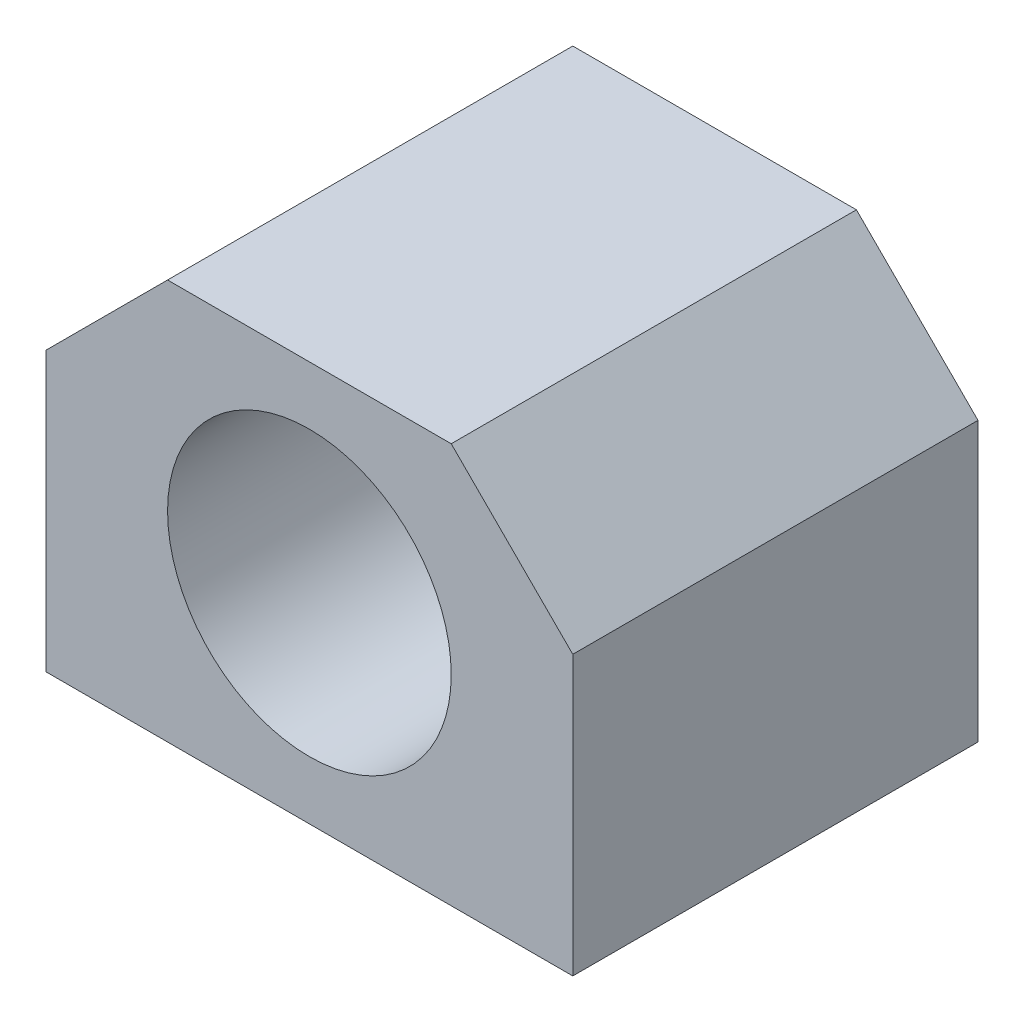
ISO-10303-21;
HEADER;
FILE_DESCRIPTION(('STEP AP214'),'2;1');
FILE_NAME('part.step','',(''),(''),'','','');
FILE_SCHEMA(('AUTOMOTIVE_DESIGN { 1 0 10303 214 1 1 1 1 }'));
ENDSEC;
DATA;
#1=APPLICATION_CONTEXT('core data for automotive mechanical design processes');
#2=APPLICATION_PROTOCOL_DEFINITION('international standard','automotive_design',2000,#1);
#3=PRODUCT_CONTEXT('',#1,'mechanical');
#4=PRODUCT('Part','Part','',(#3));
#5=PRODUCT_RELATED_PRODUCT_CATEGORY('part','',(#4));
#6=PRODUCT_DEFINITION_FORMATION('','',#4);
#7=PRODUCT_DEFINITION_CONTEXT('part definition',#1,'design');
#8=PRODUCT_DEFINITION('design','',#6,#7);
#9=PRODUCT_DEFINITION_SHAPE('','',#8);
#10=(LENGTH_UNIT() NAMED_UNIT(*) SI_UNIT(.MILLI.,.METRE.));
#11=(NAMED_UNIT(*) PLANE_ANGLE_UNIT() SI_UNIT($,.RADIAN.));
#12=(NAMED_UNIT(*) SI_UNIT($,.STERADIAN.) SOLID_ANGLE_UNIT());
#13=UNCERTAINTY_MEASURE_WITH_UNIT(LENGTH_MEASURE(1.E-05),#10,'distance_accuracy_value','');
#14=(GEOMETRIC_REPRESENTATION_CONTEXT(3) GLOBAL_UNCERTAINTY_ASSIGNED_CONTEXT((#13)) GLOBAL_UNIT_ASSIGNED_CONTEXT((#10,
#11,#12)) REPRESENTATION_CONTEXT('',''));
#15=CARTESIAN_POINT('',(0.,0.,0.));
#16=DIRECTION('',(0.,0.,1.));
#17=DIRECTION('',(1.,0.,0.));
#18=AXIS2_PLACEMENT_3D('',#15,#16,#17);
#19=CARTESIAN_POINT('',(0.,-19.75,40.));
#20=DIRECTION('',(0.,1.,0.));
#21=DIRECTION('',(0.,0.,1.));
#22=AXIS2_PLACEMENT_3D('',#19,#20,#21);
#23=PLANE('',#22);
#24=CARTESIAN_POINT('',(-20.,-19.75,8.));
#25=DIRECTION('',(0.,-1.,0.));
#26=DIRECTION('',(0.,0.,-1.));
#27=AXIS2_PLACEMENT_3D('',#24,#25,#26);
#28=CIRCLE('',#27,2.5);
#29=CARTESIAN_POINT('',(-20.,-19.75,5.5));
#30=VERTEX_POINT('',#29);
#31=EDGE_CURVE('E206',#30,#30,#28,.T.);
#32=ORIENTED_EDGE('',*,*,#31,.F.);
#33=EDGE_LOOP('',(#32));
#34=FACE_BOUND('',#33,.T.);
#35=CARTESIAN_POINT('',(20.,-19.75,32.));
#36=DIRECTION('',(0.,-1.,0.));
#37=DIRECTION('',(0.,0.,-1.));
#38=AXIS2_PLACEMENT_3D('',#35,#36,#37);
#39=CIRCLE('',#38,2.5);
#40=CARTESIAN_POINT('',(20.,-19.75,29.5));
#41=VERTEX_POINT('',#40);
#42=EDGE_CURVE('E200',#41,#41,#39,.T.);
#43=ORIENTED_EDGE('',*,*,#42,.F.);
#44=EDGE_LOOP('',(#43));
#45=FACE_BOUND('',#44,.T.);
#46=CARTESIAN_POINT('',(-20.,-19.75,32.));
#47=DIRECTION('',(0.,-1.,0.));
#48=DIRECTION('',(0.,0.,-1.));
#49=AXIS2_PLACEMENT_3D('',#46,#47,#48);
#50=CIRCLE('',#49,2.5);
#51=CARTESIAN_POINT('',(-20.,-19.75,29.5));
#52=VERTEX_POINT('',#51);
#53=EDGE_CURVE('E194',#52,#52,#50,.T.);
#54=ORIENTED_EDGE('',*,*,#53,.F.);
#55=EDGE_LOOP('',(#54));
#56=FACE_BOUND('',#55,.T.);
#57=CARTESIAN_POINT('',(20.,-19.75,8.00000000000001));
#58=DIRECTION('',(0.,-1.,0.));
#59=DIRECTION('',(0.,0.,-1.));
#60=AXIS2_PLACEMENT_3D('',#57,#58,#59);
#61=CIRCLE('',#60,2.5);
#62=CARTESIAN_POINT('',(20.,-19.75,5.50000000000001));
#63=VERTEX_POINT('',#62);
#64=EDGE_CURVE('E188',#63,#63,#61,.T.);
#65=ORIENTED_EDGE('',*,*,#64,.F.);
#66=EDGE_LOOP('',(#65));
#67=FACE_BOUND('',#66,.T.);
#68=DIRECTION('',(1.,0.,0.));
#69=VECTOR('',#68,1.);
#70=CARTESIAN_POINT('',(0.,-19.75,0.));
#71=LINE('',#70,#69);
#72=CARTESIAN_POINT('',(-26.,-19.75,0.));
#73=VERTEX_POINT('',#72);
#74=CARTESIAN_POINT('',(26.,-19.75,0.));
#75=VERTEX_POINT('',#74);
#76=EDGE_CURVE('E103',#73,#75,#71,.T.);
#77=ORIENTED_EDGE('',*,*,#76,.T.);
#78=DIRECTION('',(0.,0.,-1.));
#79=VECTOR('',#78,1.);
#80=CARTESIAN_POINT('',(26.,-19.75,40.));
#81=LINE('',#80,#79);
#82=CARTESIAN_POINT('',(26.,-19.75,40.));
#83=VERTEX_POINT('',#82);
#84=EDGE_CURVE('E89',#83,#75,#81,.T.);
#85=ORIENTED_EDGE('',*,*,#84,.F.);
#86=DIRECTION('',(1.,0.,0.));
#87=VECTOR('',#86,1.);
#88=CARTESIAN_POINT('',(0.,-19.75,40.));
#89=LINE('',#88,#87);
#90=CARTESIAN_POINT('',(-26.,-19.75,40.));
#91=VERTEX_POINT('',#90);
#92=EDGE_CURVE('E92',#91,#83,#89,.T.);
#93=ORIENTED_EDGE('',*,*,#92,.F.);
#94=DIRECTION('',(0.,0.,-1.));
#95=VECTOR('',#94,1.);
#96=CARTESIAN_POINT('',(-26.,-19.75,40.));
#97=LINE('',#96,#95);
#98=EDGE_CURVE('E105',#91,#73,#97,.T.);
#99=ORIENTED_EDGE('',*,*,#98,.T.);
#100=EDGE_LOOP('',(#77,#85,#93,#99));
#101=FACE_BOUND('',#100,.T.);
#102=ADVANCED_FACE('F34',(#34,#45,#56,#67,#101),#23,.F.);
#103=CARTESIAN_POINT('',(26.,0.,40.));
#104=DIRECTION('',(-1.,0.,0.));
#105=DIRECTION('',(0.,0.,1.));
#106=AXIS2_PLACEMENT_3D('',#103,#104,#105);
#107=PLANE('',#106);
#108=DIRECTION('',(0.,1.,0.));
#109=VECTOR('',#108,1.);
#110=CARTESIAN_POINT('',(26.,0.,0.));
#111=LINE('',#110,#109);
#112=CARTESIAN_POINT('',(26.,7.74999999999996,0.));
#113=VERTEX_POINT('',#112);
#114=EDGE_CURVE('E140',#75,#113,#111,.T.);
#115=ORIENTED_EDGE('',*,*,#114,.T.);
#116=DIRECTION('',(0.,0.,1.));
#117=VECTOR('',#116,1.);
#118=CARTESIAN_POINT('',(26.,7.74999999999996,40.));
#119=LINE('',#118,#117);
#120=CARTESIAN_POINT('',(26.,7.74999999999996,40.));
#121=VERTEX_POINT('',#120);
#122=EDGE_CURVE('E11',#113,#121,#119,.T.);
#123=ORIENTED_EDGE('',*,*,#122,.T.);
#124=DIRECTION('',(0.,1.,0.));
#125=VECTOR('',#124,1.);
#126=CARTESIAN_POINT('',(26.,0.,40.));
#127=LINE('',#126,#125);
#128=EDGE_CURVE('E85',#83,#121,#127,.T.);
#129=ORIENTED_EDGE('',*,*,#128,.F.);
#130=ORIENTED_EDGE('',*,*,#84,.T.);
#131=EDGE_LOOP('',(#115,#123,#129,#130));
#132=FACE_BOUND('',#131,.T.);
#133=ADVANCED_FACE('F87',(#132),#107,.F.);
#134=CARTESIAN_POINT('',(0.,19.75,40.));
#135=DIRECTION('',(0.,1.,0.));
#136=DIRECTION('',(0.,0.,1.));
#137=AXIS2_PLACEMENT_3D('',#134,#135,#136);
#138=PLANE('',#137);
#139=DIRECTION('',(1.,0.,0.));
#140=VECTOR('',#139,1.);
#141=CARTESIAN_POINT('',(0.,19.75,0.));
#142=LINE('',#141,#140);
#143=CARTESIAN_POINT('',(-13.9999999999999,19.75,0.));
#144=VERTEX_POINT('',#143);
#145=CARTESIAN_POINT('',(14.,19.75,0.));
#146=VERTEX_POINT('',#145);
#147=EDGE_CURVE('E135',#144,#146,#142,.T.);
#148=ORIENTED_EDGE('',*,*,#147,.F.);
#149=DIRECTION('',(0.,0.,1.));
#150=VECTOR('',#149,1.);
#151=CARTESIAN_POINT('',(-13.9999999999999,19.75,40.));
#152=LINE('',#151,#150);
#153=CARTESIAN_POINT('',(-13.9999999999999,19.75,40.));
#154=VERTEX_POINT('',#153);
#155=EDGE_CURVE('E119',#144,#154,#152,.T.);
#156=ORIENTED_EDGE('',*,*,#155,.T.);
#157=DIRECTION('',(1.,0.,0.));
#158=VECTOR('',#157,1.);
#159=CARTESIAN_POINT('',(0.,19.75,40.));
#160=LINE('',#159,#158);
#161=CARTESIAN_POINT('',(14.,19.75,40.));
#162=VERTEX_POINT('',#161);
#163=EDGE_CURVE('E91',#154,#162,#160,.T.);
#164=ORIENTED_EDGE('',*,*,#163,.T.);
#165=DIRECTION('',(0.,0.,-1.));
#166=VECTOR('',#165,1.);
#167=CARTESIAN_POINT('',(14.,19.75,0.));
#168=LINE('',#167,#166);
#169=EDGE_CURVE('E116',#162,#146,#168,.T.);
#170=ORIENTED_EDGE('',*,*,#169,.T.);
#171=EDGE_LOOP('',(#148,#156,#164,#170));
#172=FACE_BOUND('',#171,.T.);
#173=ADVANCED_FACE('F138',(#172),#138,.T.);
#174=CARTESIAN_POINT('',(0.,0.,40.));
#175=DIRECTION('',(0.,0.,-1.));
#176=DIRECTION('',(-1.,0.,0.));
#177=AXIS2_PLACEMENT_3D('',#174,#175,#176);
#178=CYLINDRICAL_SURFACE('',#177,14.);
#179=CARTESIAN_POINT('',(0.,0.,40.));
#180=DIRECTION('',(0.,0.,1.));
#181=DIRECTION('',(1.,0.,0.));
#182=AXIS2_PLACEMENT_3D('',#179,#180,#181);
#183=CIRCLE('',#182,14.);
#184=CARTESIAN_POINT('',(14.,0.,40.));
#185=VERTEX_POINT('',#184);
#186=EDGE_CURVE('E100',#185,#185,#183,.T.);
#187=ORIENTED_EDGE('',*,*,#186,.T.);
#188=EDGE_LOOP('',(#187));
#189=FACE_BOUND('',#188,.T.);
#190=CARTESIAN_POINT('',(0.,0.,0.));
#191=DIRECTION('',(0.,0.,1.));
#192=DIRECTION('',(1.,0.,0.));
#193=AXIS2_PLACEMENT_3D('',#190,#191,#192);
#194=CIRCLE('',#193,14.);
#195=CARTESIAN_POINT('',(14.,0.,0.));
#196=VERTEX_POINT('',#195);
#197=EDGE_CURVE('E145',#196,#196,#194,.T.);
#198=ORIENTED_EDGE('',*,*,#197,.F.);
#199=EDGE_LOOP('',(#198));
#200=FACE_BOUND('',#199,.T.);
#201=ADVANCED_FACE('F300',(#189,#200),#178,.F.);
#202=CARTESIAN_POINT('',(-26.,0.,40.));
#203=DIRECTION('',(-1.,0.,0.));
#204=DIRECTION('',(0.,0.,1.));
#205=AXIS2_PLACEMENT_3D('',#202,#203,#204);
#206=PLANE('',#205);
#207=DIRECTION('',(0.,1.,0.));
#208=VECTOR('',#207,1.);
#209=CARTESIAN_POINT('',(-26.,0.,40.));
#210=LINE('',#209,#208);
#211=CARTESIAN_POINT('',(-26.,7.74999999999999,40.));
#212=VERTEX_POINT('',#211);
#213=EDGE_CURVE('E98',#91,#212,#210,.T.);
#214=ORIENTED_EDGE('',*,*,#213,.T.);
#215=DIRECTION('',(0.,0.,-1.));
#216=VECTOR('',#215,1.);
#217=CARTESIAN_POINT('',(-26.,7.74999999999999,40.));
#218=LINE('',#217,#216);
#219=CARTESIAN_POINT('',(-26.,7.74999999999999,0.));
#220=VERTEX_POINT('',#219);
#221=EDGE_CURVE('E104',#212,#220,#218,.T.);
#222=ORIENTED_EDGE('',*,*,#221,.T.);
#223=DIRECTION('',(0.,1.,0.));
#224=VECTOR('',#223,1.);
#225=CARTESIAN_POINT('',(-26.,0.,0.));
#226=LINE('',#225,#224);
#227=EDGE_CURVE('E136',#73,#220,#226,.T.);
#228=ORIENTED_EDGE('',*,*,#227,.F.);
#229=ORIENTED_EDGE('',*,*,#98,.F.);
#230=EDGE_LOOP('',(#214,#222,#228,#229));
#231=FACE_BOUND('',#230,.T.);
#232=ADVANCED_FACE('F126',(#231),#206,.T.);
#233=CARTESIAN_POINT('',(0.,0.,40.));
#234=DIRECTION('',(0.,0.,1.));
#235=DIRECTION('',(1.,0.,0.));
#236=AXIS2_PLACEMENT_3D('',#233,#234,#235);
#237=PLANE('',#236);
#238=ORIENTED_EDGE('',*,*,#186,.F.);
#239=EDGE_LOOP('',(#238));
#240=FACE_BOUND('',#239,.T.);
#241=ORIENTED_EDGE('',*,*,#163,.F.);
#242=DIRECTION('',(0.707106781186549,0.707106781186546,0.));
#243=VECTOR('',#242,1.);
#244=CARTESIAN_POINT('',(-16.875,16.875,40.));
#245=LINE('',#244,#243);
#246=EDGE_CURVE('E42',#154,#212,#245,.F.);
#247=ORIENTED_EDGE('',*,*,#246,.T.);
#248=ORIENTED_EDGE('',*,*,#213,.F.);
#249=ORIENTED_EDGE('',*,*,#92,.T.);
#250=ORIENTED_EDGE('',*,*,#128,.T.);
#251=DIRECTION('',(-0.707106781186546,0.707106781186549,0.));
#252=VECTOR('',#251,1.);
#253=CARTESIAN_POINT('',(16.875,16.875,40.));
#254=LINE('',#253,#252);
#255=EDGE_CURVE('E54',#121,#162,#254,.T.);
#256=ORIENTED_EDGE('',*,*,#255,.T.);
#257=EDGE_LOOP('',(#241,#247,#248,#249,#250,#256));
#258=FACE_BOUND('',#257,.T.);
#259=ADVANCED_FACE('F96',(#240,#258),#237,.T.);
#260=CARTESIAN_POINT('',(0.,0.,0.));
#261=DIRECTION('',(0.,0.,1.));
#262=DIRECTION('',(1.,0.,0.));
#263=AXIS2_PLACEMENT_3D('',#260,#261,#262);
#264=PLANE('',#263);
#265=CARTESIAN_POINT('',(18.75,0.,0.));
#266=DIRECTION('',(0.,0.,1.));
#267=DIRECTION('',(1.,0.,0.));
#268=AXIS2_PLACEMENT_3D('',#265,#266,#267);
#269=CIRCLE('',#268,2.5);
#270=CARTESIAN_POINT('',(21.25,0.,0.));
#271=VERTEX_POINT('',#270);
#272=EDGE_CURVE('E183',#271,#271,#269,.T.);
#273=ORIENTED_EDGE('',*,*,#272,.T.);
#274=EDGE_LOOP('',(#273));
#275=FACE_BOUND('',#274,.T.);
#276=CARTESIAN_POINT('',(13.2582521472489,-13.2582521472482,0.));
#277=DIRECTION('',(0.,0.,1.));
#278=DIRECTION('',(1.,0.,0.));
#279=AXIS2_PLACEMENT_3D('',#276,#277,#278);
#280=CIRCLE('',#279,2.49999999999881);
#281=CARTESIAN_POINT('',(15.7582521472477,-13.2582521472482,0.));
#282=VERTEX_POINT('',#281);
#283=EDGE_CURVE('E177',#282,#282,#280,.T.);
#284=ORIENTED_EDGE('',*,*,#283,.T.);
#285=EDGE_LOOP('',(#284));
#286=FACE_BOUND('',#285,.T.);
#287=CARTESIAN_POINT('',(-13.2582521472467,-13.2582521472504,0.));
#288=DIRECTION('',(0.,0.,1.));
#289=DIRECTION('',(1.,0.,0.));
#290=AXIS2_PLACEMENT_3D('',#287,#288,#289);
#291=CIRCLE('',#290,2.49999999999815);
#292=CARTESIAN_POINT('',(-10.7582521472485,-13.2582521472504,0.));
#293=VERTEX_POINT('',#292);
#294=EDGE_CURVE('E171',#293,#293,#291,.T.);
#295=ORIENTED_EDGE('',*,*,#294,.T.);
#296=EDGE_LOOP('',(#295));
#297=FACE_BOUND('',#296,.T.);
#298=CARTESIAN_POINT('',(-18.75,-3.10840992437321E-12,0.));
#299=DIRECTION('',(0.,0.,1.));
#300=DIRECTION('',(1.,0.,0.));
#301=AXIS2_PLACEMENT_3D('',#298,#299,#300);
#302=CIRCLE('',#301,2.49999999999905);
#303=CARTESIAN_POINT('',(-16.250000000001,-3.10840992437321E-12,0.));
#304=VERTEX_POINT('',#303);
#305=EDGE_CURVE('E165',#304,#304,#302,.T.);
#306=ORIENTED_EDGE('',*,*,#305,.T.);
#307=EDGE_LOOP('',(#306));
#308=FACE_BOUND('',#307,.T.);
#309=CARTESIAN_POINT('',(-13.2582521472489,13.2582521472451,0.));
#310=DIRECTION('',(0.,0.,1.));
#311=DIRECTION('',(1.,0.,0.));
#312=AXIS2_PLACEMENT_3D('',#309,#310,#311);
#313=CIRCLE('',#312,2.50000000000023);
#314=CARTESIAN_POINT('',(-10.7582521472486,13.2582521472451,0.));
#315=VERTEX_POINT('',#314);
#316=EDGE_CURVE('E158',#315,#315,#313,.T.);
#317=ORIENTED_EDGE('',*,*,#316,.T.);
#318=EDGE_LOOP('',(#317));
#319=FACE_BOUND('',#318,.T.);
#320=CARTESIAN_POINT('',(13.2582521472467,13.2582521472473,0.));
#321=DIRECTION('',(0.,0.,1.));
#322=DIRECTION('',(1.,0.,0.));
#323=AXIS2_PLACEMENT_3D('',#320,#321,#322);
#324=CIRCLE('',#323,2.50000000000085);
#325=CARTESIAN_POINT('',(15.7582521472475,13.2582521472473,0.));
#326=VERTEX_POINT('',#325);
#327=EDGE_CURVE('E152',#326,#326,#324,.T.);
#328=ORIENTED_EDGE('',*,*,#327,.T.);
#329=EDGE_LOOP('',(#328));
#330=FACE_BOUND('',#329,.T.);
#331=ORIENTED_EDGE('',*,*,#197,.T.);
#332=EDGE_LOOP('',(#331));
#333=FACE_BOUND('',#332,.T.);
#334=ORIENTED_EDGE('',*,*,#227,.T.);
#335=DIRECTION('',(-0.707106781186549,-0.707106781186546,0.));
#336=VECTOR('',#335,1.);
#337=CARTESIAN_POINT('',(-26.,7.74999999999999,0.));
#338=LINE('',#337,#336);
#339=EDGE_CURVE('E114',#220,#144,#338,.F.);
#340=ORIENTED_EDGE('',*,*,#339,.T.);
#341=ORIENTED_EDGE('',*,*,#147,.T.);
#342=DIRECTION('',(0.707106781186546,-0.707106781186549,0.));
#343=VECTOR('',#342,1.);
#344=CARTESIAN_POINT('',(14.,19.75,0.));
#345=LINE('',#344,#343);
#346=EDGE_CURVE('E108',#146,#113,#345,.T.);
#347=ORIENTED_EDGE('',*,*,#346,.T.);
#348=ORIENTED_EDGE('',*,*,#114,.F.);
#349=ORIENTED_EDGE('',*,*,#76,.F.);
#350=EDGE_LOOP('',(#334,#340,#341,#347,#348,#349));
#351=FACE_BOUND('',#350,.T.);
#352=ADVANCED_FACE('F134',(#275,#286,#297,#308,#319,#330,#333,#351),#264,.F.);
#353=CARTESIAN_POINT('',(-26.,7.74999999999999,40.));
#354=DIRECTION('',(0.707106781186546,-0.707106781186549,0.));
#355=DIRECTION('',(0.,0.,-1.));
#356=AXIS2_PLACEMENT_3D('',#353,#354,#355);
#357=PLANE('',#356);
#358=ORIENTED_EDGE('',*,*,#246,.F.);
#359=ORIENTED_EDGE('',*,*,#155,.F.);
#360=ORIENTED_EDGE('',*,*,#339,.F.);
#361=ORIENTED_EDGE('',*,*,#221,.F.);
#362=EDGE_LOOP('',(#358,#359,#360,#361));
#363=FACE_BOUND('',#362,.T.);
#364=ADVANCED_FACE('F130',(#363),#357,.F.);
#365=CARTESIAN_POINT('',(14.,19.75,40.));
#366=DIRECTION('',(0.707106781186549,0.707106781186546,0.));
#367=DIRECTION('',(0.,0.,1.));
#368=AXIS2_PLACEMENT_3D('',#365,#366,#367);
#369=PLANE('',#368);
#370=ORIENTED_EDGE('',*,*,#255,.F.);
#371=ORIENTED_EDGE('',*,*,#122,.F.);
#372=ORIENTED_EDGE('',*,*,#346,.F.);
#373=ORIENTED_EDGE('',*,*,#169,.F.);
#374=EDGE_LOOP('',(#370,#371,#372,#373));
#375=FACE_BOUND('',#374,.T.);
#376=ADVANCED_FACE('F36',(#375),#369,.T.);
#377=CARTESIAN_POINT('',(13.2582521472467,13.2582521472473,16.5));
#378=DIRECTION('',(0.,0.,-1.));
#379=DIRECTION('',(-1.,0.,0.));
#380=AXIS2_PLACEMENT_3D('',#377,#378,#379);
#381=CYLINDRICAL_SURFACE('',#380,2.50000000000085);
#382=CARTESIAN_POINT('',(13.2582521472467,13.2582521472473,16.5));
#383=DIRECTION('',(0.,0.,1.));
#384=DIRECTION('',(1.,0.,0.));
#385=AXIS2_PLACEMENT_3D('',#382,#383,#384);
#386=CIRCLE('',#385,2.50000000000085);
#387=CARTESIAN_POINT('',(15.7582521472475,13.2582521472473,16.5));
#388=VERTEX_POINT('',#387);
#389=EDGE_CURVE('E147',#388,#388,#386,.T.);
#390=ORIENTED_EDGE('',*,*,#389,.T.);
#391=EDGE_LOOP('',(#390));
#392=FACE_BOUND('',#391,.T.);
#393=ORIENTED_EDGE('',*,*,#327,.F.);
#394=EDGE_LOOP('',(#393));
#395=FACE_BOUND('',#394,.T.);
#396=ADVANCED_FACE('F287',(#392,#395),#381,.F.);
#397=CARTESIAN_POINT('',(0.,0.,16.5));
#398=DIRECTION('',(0.,0.,1.));
#399=DIRECTION('',(1.,0.,0.));
#400=AXIS2_PLACEMENT_3D('',#397,#398,#399);
#401=PLANE('',#400);
#402=ORIENTED_EDGE('',*,*,#389,.F.);
#403=EDGE_LOOP('',(#402));
#404=FACE_BOUND('',#403,.T.);
#405=ADVANCED_FACE('F283',(#404),#401,.F.);
#406=CARTESIAN_POINT('',(-13.2582521472489,13.2582521472451,16.5));
#407=DIRECTION('',(0.,0.,-1.));
#408=DIRECTION('',(-1.,0.,0.));
#409=AXIS2_PLACEMENT_3D('',#406,#407,#408);
#410=CYLINDRICAL_SURFACE('',#409,2.50000000000023);
#411=CARTESIAN_POINT('',(-13.2582521472489,13.2582521472451,16.5));
#412=DIRECTION('',(0.,0.,1.));
#413=DIRECTION('',(1.,0.,0.));
#414=AXIS2_PLACEMENT_3D('',#411,#412,#413);
#415=CIRCLE('',#414,2.50000000000023);
#416=CARTESIAN_POINT('',(-10.7582521472486,13.2582521472451,16.5));
#417=VERTEX_POINT('',#416);
#418=EDGE_CURVE('E161',#417,#417,#415,.T.);
#419=ORIENTED_EDGE('',*,*,#418,.T.);
#420=EDGE_LOOP('',(#419));
#421=FACE_BOUND('',#420,.T.);
#422=ORIENTED_EDGE('',*,*,#316,.F.);
#423=EDGE_LOOP('',(#422));
#424=FACE_BOUND('',#423,.T.);
#425=ADVANCED_FACE('F279',(#421,#424),#410,.F.);
#426=CARTESIAN_POINT('',(0.,0.,16.5));
#427=DIRECTION('',(0.,0.,1.));
#428=DIRECTION('',(1.,0.,0.));
#429=AXIS2_PLACEMENT_3D('',#426,#427,#428);
#430=PLANE('',#429);
#431=ORIENTED_EDGE('',*,*,#418,.F.);
#432=EDGE_LOOP('',(#431));
#433=FACE_BOUND('',#432,.T.);
#434=ADVANCED_FACE('F275',(#433),#430,.F.);
#435=CARTESIAN_POINT('',(-18.75,-3.10840992437321E-12,16.5));
#436=DIRECTION('',(0.,0.,-1.));
#437=DIRECTION('',(-1.,0.,0.));
#438=AXIS2_PLACEMENT_3D('',#435,#436,#437);
#439=CYLINDRICAL_SURFACE('',#438,2.49999999999905);
#440=CARTESIAN_POINT('',(-18.75,-3.10840992437321E-12,16.5));
#441=DIRECTION('',(0.,0.,1.));
#442=DIRECTION('',(1.,0.,0.));
#443=AXIS2_PLACEMENT_3D('',#440,#441,#442);
#444=CIRCLE('',#443,2.49999999999905);
#445=CARTESIAN_POINT('',(-16.250000000001,-3.10840992437321E-12,16.5));
#446=VERTEX_POINT('',#445);
#447=EDGE_CURVE('E168',#446,#446,#444,.T.);
#448=ORIENTED_EDGE('',*,*,#447,.T.);
#449=EDGE_LOOP('',(#448));
#450=FACE_BOUND('',#449,.T.);
#451=ORIENTED_EDGE('',*,*,#305,.F.);
#452=EDGE_LOOP('',(#451));
#453=FACE_BOUND('',#452,.T.);
#454=ADVANCED_FACE('F271',(#450,#453),#439,.F.);
#455=CARTESIAN_POINT('',(0.,0.,16.5));
#456=DIRECTION('',(0.,0.,1.));
#457=DIRECTION('',(1.,0.,0.));
#458=AXIS2_PLACEMENT_3D('',#455,#456,#457);
#459=PLANE('',#458);
#460=ORIENTED_EDGE('',*,*,#447,.F.);
#461=EDGE_LOOP('',(#460));
#462=FACE_BOUND('',#461,.T.);
#463=ADVANCED_FACE('F267',(#462),#459,.F.);
#464=CARTESIAN_POINT('',(-13.2582521472467,-13.2582521472504,16.5));
#465=DIRECTION('',(0.,0.,-1.));
#466=DIRECTION('',(-1.,0.,0.));
#467=AXIS2_PLACEMENT_3D('',#464,#465,#466);
#468=CYLINDRICAL_SURFACE('',#467,2.49999999999815);
#469=CARTESIAN_POINT('',(-13.2582521472467,-13.2582521472504,16.5));
#470=DIRECTION('',(0.,0.,1.));
#471=DIRECTION('',(1.,0.,0.));
#472=AXIS2_PLACEMENT_3D('',#469,#470,#471);
#473=CIRCLE('',#472,2.49999999999815);
#474=CARTESIAN_POINT('',(-10.7582521472485,-13.2582521472504,16.5));
#475=VERTEX_POINT('',#474);
#476=EDGE_CURVE('E174',#475,#475,#473,.T.);
#477=ORIENTED_EDGE('',*,*,#476,.T.);
#478=EDGE_LOOP('',(#477));
#479=FACE_BOUND('',#478,.T.);
#480=ORIENTED_EDGE('',*,*,#294,.F.);
#481=EDGE_LOOP('',(#480));
#482=FACE_BOUND('',#481,.T.);
#483=ADVANCED_FACE('F263',(#479,#482),#468,.F.);
#484=CARTESIAN_POINT('',(0.,0.,16.5));
#485=DIRECTION('',(0.,0.,1.));
#486=DIRECTION('',(1.,0.,0.));
#487=AXIS2_PLACEMENT_3D('',#484,#485,#486);
#488=PLANE('',#487);
#489=ORIENTED_EDGE('',*,*,#476,.F.);
#490=EDGE_LOOP('',(#489));
#491=FACE_BOUND('',#490,.T.);
#492=ADVANCED_FACE('F259',(#491),#488,.F.);
#493=CARTESIAN_POINT('',(13.2582521472489,-13.2582521472482,16.5));
#494=DIRECTION('',(0.,0.,-1.));
#495=DIRECTION('',(-1.,0.,0.));
#496=AXIS2_PLACEMENT_3D('',#493,#494,#495);
#497=CYLINDRICAL_SURFACE('',#496,2.49999999999881);
#498=CARTESIAN_POINT('',(13.2582521472489,-13.2582521472482,16.5));
#499=DIRECTION('',(0.,0.,1.));
#500=DIRECTION('',(1.,0.,0.));
#501=AXIS2_PLACEMENT_3D('',#498,#499,#500);
#502=CIRCLE('',#501,2.49999999999881);
#503=CARTESIAN_POINT('',(15.7582521472477,-13.2582521472482,16.5));
#504=VERTEX_POINT('',#503);
#505=EDGE_CURVE('E180',#504,#504,#502,.T.);
#506=ORIENTED_EDGE('',*,*,#505,.T.);
#507=EDGE_LOOP('',(#506));
#508=FACE_BOUND('',#507,.T.);
#509=ORIENTED_EDGE('',*,*,#283,.F.);
#510=EDGE_LOOP('',(#509));
#511=FACE_BOUND('',#510,.T.);
#512=ADVANCED_FACE('F255',(#508,#511),#497,.F.);
#513=CARTESIAN_POINT('',(0.,0.,16.5));
#514=DIRECTION('',(0.,0.,1.));
#515=DIRECTION('',(1.,0.,0.));
#516=AXIS2_PLACEMENT_3D('',#513,#514,#515);
#517=PLANE('',#516);
#518=ORIENTED_EDGE('',*,*,#505,.F.);
#519=EDGE_LOOP('',(#518));
#520=FACE_BOUND('',#519,.T.);
#521=ADVANCED_FACE('F251',(#520),#517,.F.);
#522=CARTESIAN_POINT('',(18.75,0.,16.5));
#523=DIRECTION('',(0.,0.,-1.));
#524=DIRECTION('',(-1.,0.,0.));
#525=AXIS2_PLACEMENT_3D('',#522,#523,#524);
#526=CYLINDRICAL_SURFACE('',#525,2.5);
#527=CARTESIAN_POINT('',(18.75,0.,16.5));
#528=DIRECTION('',(0.,0.,1.));
#529=DIRECTION('',(1.,0.,0.));
#530=AXIS2_PLACEMENT_3D('',#527,#528,#529);
#531=CIRCLE('',#530,2.5);
#532=CARTESIAN_POINT('',(21.25,0.,16.5));
#533=VERTEX_POINT('',#532);
#534=EDGE_CURVE('E155',#533,#533,#531,.T.);
#535=ORIENTED_EDGE('',*,*,#534,.T.);
#536=EDGE_LOOP('',(#535));
#537=FACE_BOUND('',#536,.T.);
#538=ORIENTED_EDGE('',*,*,#272,.F.);
#539=EDGE_LOOP('',(#538));
#540=FACE_BOUND('',#539,.T.);
#541=ADVANCED_FACE('F243',(#537,#540),#526,.F.);
#542=CARTESIAN_POINT('',(0.,0.,16.5));
#543=DIRECTION('',(0.,0.,1.));
#544=DIRECTION('',(1.,0.,0.));
#545=AXIS2_PLACEMENT_3D('',#542,#543,#544);
#546=PLANE('',#545);
#547=ORIENTED_EDGE('',*,*,#534,.F.);
#548=EDGE_LOOP('',(#547));
#549=FACE_BOUND('',#548,.T.);
#550=ADVANCED_FACE('F233',(#549),#546,.F.);
#551=CARTESIAN_POINT('',(20.,-11.75,8.00000000000001));
#552=DIRECTION('',(0.,-1.,0.));
#553=DIRECTION('',(0.,0.,-1.));
#554=AXIS2_PLACEMENT_3D('',#551,#552,#553);
#555=CYLINDRICAL_SURFACE('',#554,2.5);
#556=CARTESIAN_POINT('',(20.,-11.75,8.00000000000001));
#557=DIRECTION('',(0.,-1.,0.));
#558=DIRECTION('',(0.,0.,-1.));
#559=AXIS2_PLACEMENT_3D('',#556,#557,#558);
#560=CIRCLE('',#559,2.5);
#561=CARTESIAN_POINT('',(20.,-11.75,5.50000000000001));
#562=VERTEX_POINT('',#561);
#563=EDGE_CURVE('E162',#562,#562,#560,.T.);
#564=ORIENTED_EDGE('',*,*,#563,.F.);
#565=EDGE_LOOP('',(#564));
#566=FACE_BOUND('',#565,.T.);
#567=ORIENTED_EDGE('',*,*,#64,.T.);
#568=EDGE_LOOP('',(#567));
#569=FACE_BOUND('',#568,.T.);
#570=ADVANCED_FACE('F230',(#566,#569),#555,.F.);
#571=CARTESIAN_POINT('',(20.,-11.75,8.00000000000001));
#572=DIRECTION('',(0.,-1.,0.));
#573=DIRECTION('',(0.,0.,-1.));
#574=AXIS2_PLACEMENT_3D('',#571,#572,#573);
#575=PLANE('',#574);
#576=ORIENTED_EDGE('',*,*,#563,.T.);
#577=EDGE_LOOP('',(#576));
#578=FACE_BOUND('',#577,.T.);
#579=ADVANCED_FACE('F232',(#578),#575,.T.);
#580=CARTESIAN_POINT('',(-20.,-11.75,32.));
#581=DIRECTION('',(0.,-1.,0.));
#582=DIRECTION('',(0.,0.,-1.));
#583=AXIS2_PLACEMENT_3D('',#580,#581,#582);
#584=CYLINDRICAL_SURFACE('',#583,2.5);
#585=CARTESIAN_POINT('',(-20.,-11.75,32.));
#586=DIRECTION('',(0.,-1.,0.));
#587=DIRECTION('',(0.,0.,-1.));
#588=AXIS2_PLACEMENT_3D('',#585,#586,#587);
#589=CIRCLE('',#588,2.5);
#590=CARTESIAN_POINT('',(-20.,-11.75,29.5));
#591=VERTEX_POINT('',#590);
#592=EDGE_CURVE('E197',#591,#591,#589,.T.);
#593=ORIENTED_EDGE('',*,*,#592,.F.);
#594=EDGE_LOOP('',(#593));
#595=FACE_BOUND('',#594,.T.);
#596=ORIENTED_EDGE('',*,*,#53,.T.);
#597=EDGE_LOOP('',(#596));
#598=FACE_BOUND('',#597,.T.);
#599=ADVANCED_FACE('F240',(#595,#598),#584,.F.);
#600=CARTESIAN_POINT('',(-20.,-11.75,32.));
#601=DIRECTION('',(0.,-1.,0.));
#602=DIRECTION('',(0.,0.,-1.));
#603=AXIS2_PLACEMENT_3D('',#600,#601,#602);
#604=PLANE('',#603);
#605=ORIENTED_EDGE('',*,*,#592,.T.);
#606=EDGE_LOOP('',(#605));
#607=FACE_BOUND('',#606,.T.);
#608=ADVANCED_FACE('F389',(#607),#604,.T.);
#609=CARTESIAN_POINT('',(20.,-11.75,32.));
#610=DIRECTION('',(0.,-1.,0.));
#611=DIRECTION('',(0.,0.,-1.));
#612=AXIS2_PLACEMENT_3D('',#609,#610,#611);
#613=CYLINDRICAL_SURFACE('',#612,2.5);
#614=CARTESIAN_POINT('',(20.,-11.75,32.));
#615=DIRECTION('',(0.,-1.,0.));
#616=DIRECTION('',(0.,0.,-1.));
#617=AXIS2_PLACEMENT_3D('',#614,#615,#616);
#618=CIRCLE('',#617,2.5);
#619=CARTESIAN_POINT('',(20.,-11.75,29.5));
#620=VERTEX_POINT('',#619);
#621=EDGE_CURVE('E203',#620,#620,#618,.T.);
#622=ORIENTED_EDGE('',*,*,#621,.F.);
#623=EDGE_LOOP('',(#622));
#624=FACE_BOUND('',#623,.T.);
#625=ORIENTED_EDGE('',*,*,#42,.T.);
#626=EDGE_LOOP('',(#625));
#627=FACE_BOUND('',#626,.T.);
#628=ADVANCED_FACE('F398',(#624,#627),#613,.F.);
#629=CARTESIAN_POINT('',(20.,-11.75,32.));
#630=DIRECTION('',(0.,-1.,0.));
#631=DIRECTION('',(0.,0.,-1.));
#632=AXIS2_PLACEMENT_3D('',#629,#630,#631);
#633=PLANE('',#632);
#634=ORIENTED_EDGE('',*,*,#621,.T.);
#635=EDGE_LOOP('',(#634));
#636=FACE_BOUND('',#635,.T.);
#637=ADVANCED_FACE('F217',(#636),#633,.T.);
#638=CARTESIAN_POINT('',(-20.,-11.75,8.));
#639=DIRECTION('',(0.,-1.,0.));
#640=DIRECTION('',(0.,0.,-1.));
#641=AXIS2_PLACEMENT_3D('',#638,#639,#640);
#642=CYLINDRICAL_SURFACE('',#641,2.5);
#643=CARTESIAN_POINT('',(-20.,-11.75,8.));
#644=DIRECTION('',(0.,-1.,0.));
#645=DIRECTION('',(0.,0.,-1.));
#646=AXIS2_PLACEMENT_3D('',#643,#644,#645);
#647=CIRCLE('',#646,2.5);
#648=CARTESIAN_POINT('',(-20.,-11.75,5.5));
#649=VERTEX_POINT('',#648);
#650=EDGE_CURVE('E191',#649,#649,#647,.T.);
#651=ORIENTED_EDGE('',*,*,#650,.F.);
#652=EDGE_LOOP('',(#651));
#653=FACE_BOUND('',#652,.T.);
#654=ORIENTED_EDGE('',*,*,#31,.T.);
#655=EDGE_LOOP('',(#654));
#656=FACE_BOUND('',#655,.T.);
#657=ADVANCED_FACE('F214',(#653,#656),#642,.F.);
#658=CARTESIAN_POINT('',(-20.,-11.75,8.));
#659=DIRECTION('',(0.,-1.,0.));
#660=DIRECTION('',(0.,0.,-1.));
#661=AXIS2_PLACEMENT_3D('',#658,#659,#660);
#662=PLANE('',#661);
#663=ORIENTED_EDGE('',*,*,#650,.T.);
#664=EDGE_LOOP('',(#663));
#665=FACE_BOUND('',#664,.T.);
#666=ADVANCED_FACE('F212',(#665),#662,.T.);
#667=CLOSED_SHELL('',(#102,#133,#173,#201,#232,#259,#352,#364,#376,#396,#405,#425,#434,#454,
#463,#483,#492,#512,#521,#541,#550,#570,#579,#599,#608,#628,#637,#657,#666));
#668=MANIFOLD_SOLID_BREP('B2',#667);
#669=ADVANCED_BREP_SHAPE_REPRESENTATION('',(#18,#668),#14);
#670=SHAPE_DEFINITION_REPRESENTATION(#9,#669);
ENDSEC;
END-ISO-10303-21;
